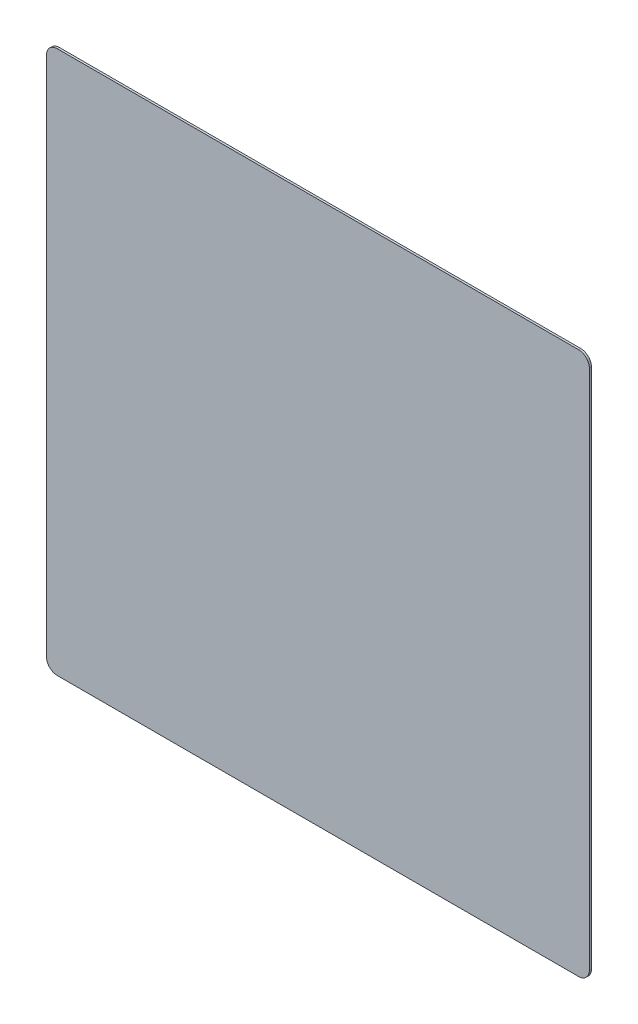
ISO-10303-21;
HEADER;
FILE_DESCRIPTION(('STEP AP214'),'2;1');
FILE_NAME('part.step','',(''),(''),'','','');
FILE_SCHEMA(('AUTOMOTIVE_DESIGN { 1 0 10303 214 1 1 1 1 }'));
ENDSEC;
DATA;
#1=APPLICATION_CONTEXT('core data for automotive mechanical design processes');
#2=APPLICATION_PROTOCOL_DEFINITION('international standard','automotive_design',2000,#1);
#3=PRODUCT_CONTEXT('',#1,'mechanical');
#4=PRODUCT('Part','Part','',(#3));
#5=PRODUCT_RELATED_PRODUCT_CATEGORY('part','',(#4));
#6=PRODUCT_DEFINITION_FORMATION('','',#4);
#7=PRODUCT_DEFINITION_CONTEXT('part definition',#1,'design');
#8=PRODUCT_DEFINITION('design','',#6,#7);
#9=PRODUCT_DEFINITION_SHAPE('','',#8);
#10=(LENGTH_UNIT() NAMED_UNIT(*) SI_UNIT(.MILLI.,.METRE.));
#11=(NAMED_UNIT(*) PLANE_ANGLE_UNIT() SI_UNIT($,.RADIAN.));
#12=(NAMED_UNIT(*) SI_UNIT($,.STERADIAN.) SOLID_ANGLE_UNIT());
#13=UNCERTAINTY_MEASURE_WITH_UNIT(LENGTH_MEASURE(1.E-05),#10,'distance_accuracy_value','');
#14=(GEOMETRIC_REPRESENTATION_CONTEXT(3) GLOBAL_UNCERTAINTY_ASSIGNED_CONTEXT((#13)) GLOBAL_UNIT_ASSIGNED_CONTEXT((#10,
#11,#12)) REPRESENTATION_CONTEXT('',''));
#15=CARTESIAN_POINT('',(0.,0.,0.));
#16=DIRECTION('',(0.,0.,1.));
#17=DIRECTION('',(1.,0.,0.));
#18=AXIS2_PLACEMENT_3D('',#15,#16,#17);
#19=CARTESIAN_POINT('',(505.,505.,4.));
#20=DIRECTION('',(-1.,0.,0.));
#21=DIRECTION('',(0.,-1.,0.));
#22=AXIS2_PLACEMENT_3D('',#19,#20,#21);
#23=PLANE('',#22);
#24=DIRECTION('',(0.,1.,0.));
#25=VECTOR('',#24,1.);
#26=CARTESIAN_POINT('',(505.,505.,4.));
#27=LINE('',#26,#25);
#28=CARTESIAN_POINT('',(505.,-485.,4.));
#29=VERTEX_POINT('',#28);
#30=CARTESIAN_POINT('',(505.,485.,4.));
#31=VERTEX_POINT('',#30);
#32=EDGE_CURVE('E118',#29,#31,#27,.T.);
#33=ORIENTED_EDGE('',*,*,#32,.F.);
#34=DIRECTION('',(0.,0.,-1.));
#35=VECTOR('',#34,1.);
#36=CARTESIAN_POINT('',(505.,-485.,4.));
#37=LINE('',#36,#35);
#38=CARTESIAN_POINT('',(505.,-485.,0.));
#39=VERTEX_POINT('',#38);
#40=EDGE_CURVE('E103',#29,#39,#37,.T.);
#41=ORIENTED_EDGE('',*,*,#40,.T.);
#42=DIRECTION('',(0.,1.,0.));
#43=VECTOR('',#42,1.);
#44=CARTESIAN_POINT('',(505.,505.,0.));
#45=LINE('',#44,#43);
#46=CARTESIAN_POINT('',(505.,485.,0.));
#47=VERTEX_POINT('',#46);
#48=EDGE_CURVE('E115',#39,#47,#45,.T.);
#49=ORIENTED_EDGE('',*,*,#48,.T.);
#50=DIRECTION('',(0.,0.,-1.));
#51=VECTOR('',#50,1.);
#52=CARTESIAN_POINT('',(505.,485.,4.));
#53=LINE('',#52,#51);
#54=EDGE_CURVE('E120',#47,#31,#53,.F.);
#55=ORIENTED_EDGE('',*,*,#54,.T.);
#56=EDGE_LOOP('',(#33,#41,#49,#55));
#57=FACE_BOUND('',#56,.T.);
#58=ADVANCED_FACE('F33',(#57),#23,.F.);
#59=CARTESIAN_POINT('',(-505.,505.,4.));
#60=DIRECTION('',(0.,-1.,0.));
#61=DIRECTION('',(0.,0.,-1.));
#62=AXIS2_PLACEMENT_3D('',#59,#60,#61);
#63=PLANE('',#62);
#64=DIRECTION('',(-1.,0.,0.));
#65=VECTOR('',#64,1.);
#66=CARTESIAN_POINT('',(-505.,505.,0.));
#67=LINE('',#66,#65);
#68=CARTESIAN_POINT('',(485.,505.,0.));
#69=VERTEX_POINT('',#68);
#70=CARTESIAN_POINT('',(-485.,505.,0.));
#71=VERTEX_POINT('',#70);
#72=EDGE_CURVE('E124',#69,#71,#67,.T.);
#73=ORIENTED_EDGE('',*,*,#72,.T.);
#74=DIRECTION('',(0.,0.,-1.));
#75=VECTOR('',#74,1.);
#76=CARTESIAN_POINT('',(-485.,505.,4.));
#77=LINE('',#76,#75);
#78=CARTESIAN_POINT('',(-485.,505.,4.));
#79=VERTEX_POINT('',#78);
#80=EDGE_CURVE('E11',#71,#79,#77,.F.);
#81=ORIENTED_EDGE('',*,*,#80,.T.);
#82=DIRECTION('',(-1.,0.,0.));
#83=VECTOR('',#82,1.);
#84=CARTESIAN_POINT('',(-505.,505.,4.));
#85=LINE('',#84,#83);
#86=CARTESIAN_POINT('',(485.,505.,4.));
#87=VERTEX_POINT('',#86);
#88=EDGE_CURVE('E160',#87,#79,#85,.T.);
#89=ORIENTED_EDGE('',*,*,#88,.F.);
#90=DIRECTION('',(0.,0.,-1.));
#91=VECTOR('',#90,1.);
#92=CARTESIAN_POINT('',(485.,505.,4.));
#93=LINE('',#92,#91);
#94=EDGE_CURVE('E41',#87,#69,#93,.T.);
#95=ORIENTED_EDGE('',*,*,#94,.T.);
#96=EDGE_LOOP('',(#73,#81,#89,#95));
#97=FACE_BOUND('',#96,.T.);
#98=ADVANCED_FACE('F158',(#97),#63,.F.);
#99=CARTESIAN_POINT('',(-505.,505.,4.));
#100=DIRECTION('',(1.,0.,0.));
#101=DIRECTION('',(0.,0.,-1.));
#102=AXIS2_PLACEMENT_3D('',#99,#100,#101);
#103=PLANE('',#102);
#104=DIRECTION('',(0.,-1.,0.));
#105=VECTOR('',#104,1.);
#106=CARTESIAN_POINT('',(-505.,505.,0.));
#107=LINE('',#106,#105);
#108=CARTESIAN_POINT('',(-505.,485.,0.));
#109=VERTEX_POINT('',#108);
#110=CARTESIAN_POINT('',(-505.,-485.,0.));
#111=VERTEX_POINT('',#110);
#112=EDGE_CURVE('E127',#109,#111,#107,.T.);
#113=ORIENTED_EDGE('',*,*,#112,.T.);
#114=DIRECTION('',(0.,0.,-1.));
#115=VECTOR('',#114,1.);
#116=CARTESIAN_POINT('',(-505.,-485.,4.));
#117=LINE('',#116,#115);
#118=CARTESIAN_POINT('',(-505.,-485.,4.));
#119=VERTEX_POINT('',#118);
#120=EDGE_CURVE('E48',#111,#119,#117,.F.);
#121=ORIENTED_EDGE('',*,*,#120,.T.);
#122=DIRECTION('',(0.,-1.,0.));
#123=VECTOR('',#122,1.);
#124=CARTESIAN_POINT('',(-505.,505.,4.));
#125=LINE('',#124,#123);
#126=CARTESIAN_POINT('',(-505.,485.,4.));
#127=VERTEX_POINT('',#126);
#128=EDGE_CURVE('E168',#127,#119,#125,.T.);
#129=ORIENTED_EDGE('',*,*,#128,.F.);
#130=DIRECTION('',(0.,0.,-1.));
#131=VECTOR('',#130,1.);
#132=CARTESIAN_POINT('',(-505.,485.,4.));
#133=LINE('',#132,#131);
#134=EDGE_CURVE('E151',#127,#109,#133,.T.);
#135=ORIENTED_EDGE('',*,*,#134,.T.);
#136=EDGE_LOOP('',(#113,#121,#129,#135));
#137=FACE_BOUND('',#136,.T.);
#138=ADVANCED_FACE('F167',(#137),#103,.F.);
#139=CARTESIAN_POINT('',(-505.,-505.,4.));
#140=DIRECTION('',(0.,1.,0.));
#141=DIRECTION('',(0.,0.,1.));
#142=AXIS2_PLACEMENT_3D('',#139,#140,#141);
#143=PLANE('',#142);
#144=DIRECTION('',(1.,0.,0.));
#145=VECTOR('',#144,1.);
#146=CARTESIAN_POINT('',(-505.,-505.,0.));
#147=LINE('',#146,#145);
#148=CARTESIAN_POINT('',(-485.,-505.,0.));
#149=VERTEX_POINT('',#148);
#150=CARTESIAN_POINT('',(485.,-505.,0.));
#151=VERTEX_POINT('',#150);
#152=EDGE_CURVE('E134',#149,#151,#147,.T.);
#153=ORIENTED_EDGE('',*,*,#152,.T.);
#154=DIRECTION('',(0.,0.,-1.));
#155=VECTOR('',#154,1.);
#156=CARTESIAN_POINT('',(485.,-505.,4.));
#157=LINE('',#156,#155);
#158=CARTESIAN_POINT('',(485.,-505.,4.));
#159=VERTEX_POINT('',#158);
#160=EDGE_CURVE('E104',#151,#159,#157,.F.);
#161=ORIENTED_EDGE('',*,*,#160,.T.);
#162=DIRECTION('',(1.,0.,0.));
#163=VECTOR('',#162,1.);
#164=CARTESIAN_POINT('',(-505.,-505.,4.));
#165=LINE('',#164,#163);
#166=CARTESIAN_POINT('',(-485.,-505.,4.));
#167=VERTEX_POINT('',#166);
#168=EDGE_CURVE('E130',#167,#159,#165,.T.);
#169=ORIENTED_EDGE('',*,*,#168,.F.);
#170=DIRECTION('',(0.,0.,-1.));
#171=VECTOR('',#170,1.);
#172=CARTESIAN_POINT('',(-485.,-505.,4.));
#173=LINE('',#172,#171);
#174=EDGE_CURVE('E109',#167,#149,#173,.T.);
#175=ORIENTED_EDGE('',*,*,#174,.T.);
#176=EDGE_LOOP('',(#153,#161,#169,#175));
#177=FACE_BOUND('',#176,.T.);
#178=ADVANCED_FACE('F196',(#177),#143,.F.);
#179=CARTESIAN_POINT('',(0.,0.,4.));
#180=DIRECTION('',(0.,0.,1.));
#181=DIRECTION('',(1.,0.,0.));
#182=AXIS2_PLACEMENT_3D('',#179,#180,#181);
#183=PLANE('',#182);
#184=ORIENTED_EDGE('',*,*,#168,.T.);
#185=CARTESIAN_POINT('',(485.,-485.,4.));
#186=DIRECTION('',(0.,0.,1.));
#187=DIRECTION('',(1.,0.,0.));
#188=AXIS2_PLACEMENT_3D('',#185,#186,#187);
#189=CIRCLE('',#188,20.);
#190=EDGE_CURVE('E149',#159,#29,#189,.T.);
#191=ORIENTED_EDGE('',*,*,#190,.T.);
#192=ORIENTED_EDGE('',*,*,#32,.T.);
#193=CARTESIAN_POINT('',(485.,485.,4.));
#194=DIRECTION('',(0.,0.,1.));
#195=DIRECTION('',(1.,0.,0.));
#196=AXIS2_PLACEMENT_3D('',#193,#194,#195);
#197=CIRCLE('',#196,20.);
#198=EDGE_CURVE('E144',#31,#87,#197,.T.);
#199=ORIENTED_EDGE('',*,*,#198,.T.);
#200=ORIENTED_EDGE('',*,*,#88,.T.);
#201=CARTESIAN_POINT('',(-485.,485.,4.));
#202=DIRECTION('',(0.,0.,1.));
#203=DIRECTION('',(1.,0.,0.));
#204=AXIS2_PLACEMENT_3D('',#201,#202,#203);
#205=CIRCLE('',#204,20.);
#206=EDGE_CURVE('E55',#79,#127,#205,.T.);
#207=ORIENTED_EDGE('',*,*,#206,.T.);
#208=ORIENTED_EDGE('',*,*,#128,.T.);
#209=CARTESIAN_POINT('',(-485.,-485.,4.));
#210=DIRECTION('',(0.,0.,1.));
#211=DIRECTION('',(1.,0.,0.));
#212=AXIS2_PLACEMENT_3D('',#209,#210,#211);
#213=CIRCLE('',#212,20.);
#214=EDGE_CURVE('E147',#119,#167,#213,.T.);
#215=ORIENTED_EDGE('',*,*,#214,.T.);
#216=EDGE_LOOP('',(#184,#191,#192,#199,#200,#207,#208,#215));
#217=FACE_BOUND('',#216,.T.);
#218=ADVANCED_FACE('F173',(#217),#183,.T.);
#219=CARTESIAN_POINT('',(0.,0.,0.));
#220=DIRECTION('',(0.,0.,1.));
#221=DIRECTION('',(1.,0.,0.));
#222=AXIS2_PLACEMENT_3D('',#219,#220,#221);
#223=PLANE('',#222);
#224=ORIENTED_EDGE('',*,*,#48,.F.);
#225=CARTESIAN_POINT('',(485.,-485.,0.));
#226=DIRECTION('',(0.,0.,1.));
#227=DIRECTION('',(1.,0.,0.));
#228=AXIS2_PLACEMENT_3D('',#225,#226,#227);
#229=CIRCLE('',#228,20.);
#230=EDGE_CURVE('E99',#39,#151,#229,.F.);
#231=ORIENTED_EDGE('',*,*,#230,.T.);
#232=ORIENTED_EDGE('',*,*,#152,.F.);
#233=CARTESIAN_POINT('',(-485.,-485.,0.));
#234=DIRECTION('',(0.,0.,1.));
#235=DIRECTION('',(1.,0.,0.));
#236=AXIS2_PLACEMENT_3D('',#233,#234,#235);
#237=CIRCLE('',#236,20.);
#238=EDGE_CURVE('E110',#149,#111,#237,.F.);
#239=ORIENTED_EDGE('',*,*,#238,.T.);
#240=ORIENTED_EDGE('',*,*,#112,.F.);
#241=CARTESIAN_POINT('',(-485.,485.,0.));
#242=DIRECTION('',(0.,0.,1.));
#243=DIRECTION('',(1.,0.,0.));
#244=AXIS2_PLACEMENT_3D('',#241,#242,#243);
#245=CIRCLE('',#244,20.);
#246=EDGE_CURVE('E138',#109,#71,#245,.F.);
#247=ORIENTED_EDGE('',*,*,#246,.T.);
#248=ORIENTED_EDGE('',*,*,#72,.F.);
#249=CARTESIAN_POINT('',(485.,485.,0.));
#250=DIRECTION('',(0.,0.,1.));
#251=DIRECTION('',(1.,0.,0.));
#252=AXIS2_PLACEMENT_3D('',#249,#250,#251);
#253=CIRCLE('',#252,20.);
#254=EDGE_CURVE('E119',#69,#47,#253,.F.);
#255=ORIENTED_EDGE('',*,*,#254,.T.);
#256=EDGE_LOOP('',(#224,#231,#232,#239,#240,#247,#248,#255));
#257=FACE_BOUND('',#256,.T.);
#258=ADVANCED_FACE('F122',(#257),#223,.F.);
#259=CARTESIAN_POINT('',(485.,-485.,4.));
#260=DIRECTION('',(0.,0.,-1.));
#261=DIRECTION('',(-1.,0.,0.));
#262=AXIS2_PLACEMENT_3D('',#259,#260,#261);
#263=CYLINDRICAL_SURFACE('',#262,20.);
#264=ORIENTED_EDGE('',*,*,#190,.F.);
#265=ORIENTED_EDGE('',*,*,#160,.F.);
#266=ORIENTED_EDGE('',*,*,#230,.F.);
#267=ORIENTED_EDGE('',*,*,#40,.F.);
#268=EDGE_LOOP('',(#264,#265,#266,#267));
#269=FACE_BOUND('',#268,.T.);
#270=ADVANCED_FACE('F102',(#269),#263,.T.);
#271=CARTESIAN_POINT('',(-485.,-485.,4.));
#272=DIRECTION('',(0.,0.,-1.));
#273=DIRECTION('',(-1.,0.,0.));
#274=AXIS2_PLACEMENT_3D('',#271,#272,#273);
#275=CYLINDRICAL_SURFACE('',#274,20.);
#276=ORIENTED_EDGE('',*,*,#214,.F.);
#277=ORIENTED_EDGE('',*,*,#120,.F.);
#278=ORIENTED_EDGE('',*,*,#238,.F.);
#279=ORIENTED_EDGE('',*,*,#174,.F.);
#280=EDGE_LOOP('',(#276,#277,#278,#279));
#281=FACE_BOUND('',#280,.T.);
#282=ADVANCED_FACE('F178',(#281),#275,.T.);
#283=CARTESIAN_POINT('',(-485.,485.,4.));
#284=DIRECTION('',(0.,0.,-1.));
#285=DIRECTION('',(-1.,0.,0.));
#286=AXIS2_PLACEMENT_3D('',#283,#284,#285);
#287=CYLINDRICAL_SURFACE('',#286,20.);
#288=ORIENTED_EDGE('',*,*,#206,.F.);
#289=ORIENTED_EDGE('',*,*,#80,.F.);
#290=ORIENTED_EDGE('',*,*,#246,.F.);
#291=ORIENTED_EDGE('',*,*,#134,.F.);
#292=EDGE_LOOP('',(#288,#289,#290,#291));
#293=FACE_BOUND('',#292,.T.);
#294=ADVANCED_FACE('F166',(#293),#287,.T.);
#295=CARTESIAN_POINT('',(485.,485.,4.));
#296=DIRECTION('',(0.,0.,-1.));
#297=DIRECTION('',(-1.,0.,0.));
#298=AXIS2_PLACEMENT_3D('',#295,#296,#297);
#299=CYLINDRICAL_SURFACE('',#298,20.);
#300=ORIENTED_EDGE('',*,*,#198,.F.);
#301=ORIENTED_EDGE('',*,*,#54,.F.);
#302=ORIENTED_EDGE('',*,*,#254,.F.);
#303=ORIENTED_EDGE('',*,*,#94,.F.);
#304=EDGE_LOOP('',(#300,#301,#302,#303));
#305=FACE_BOUND('',#304,.T.);
#306=ADVANCED_FACE('F35',(#305),#299,.T.);
#307=CLOSED_SHELL('',(#58,#98,#138,#178,#218,#258,#270,#282,#294,#306));
#308=MANIFOLD_SOLID_BREP('B2',#307);
#309=ADVANCED_BREP_SHAPE_REPRESENTATION('',(#18,#308),#14);
#310=SHAPE_DEFINITION_REPRESENTATION(#9,#309);
ENDSEC;
END-ISO-10303-21;
